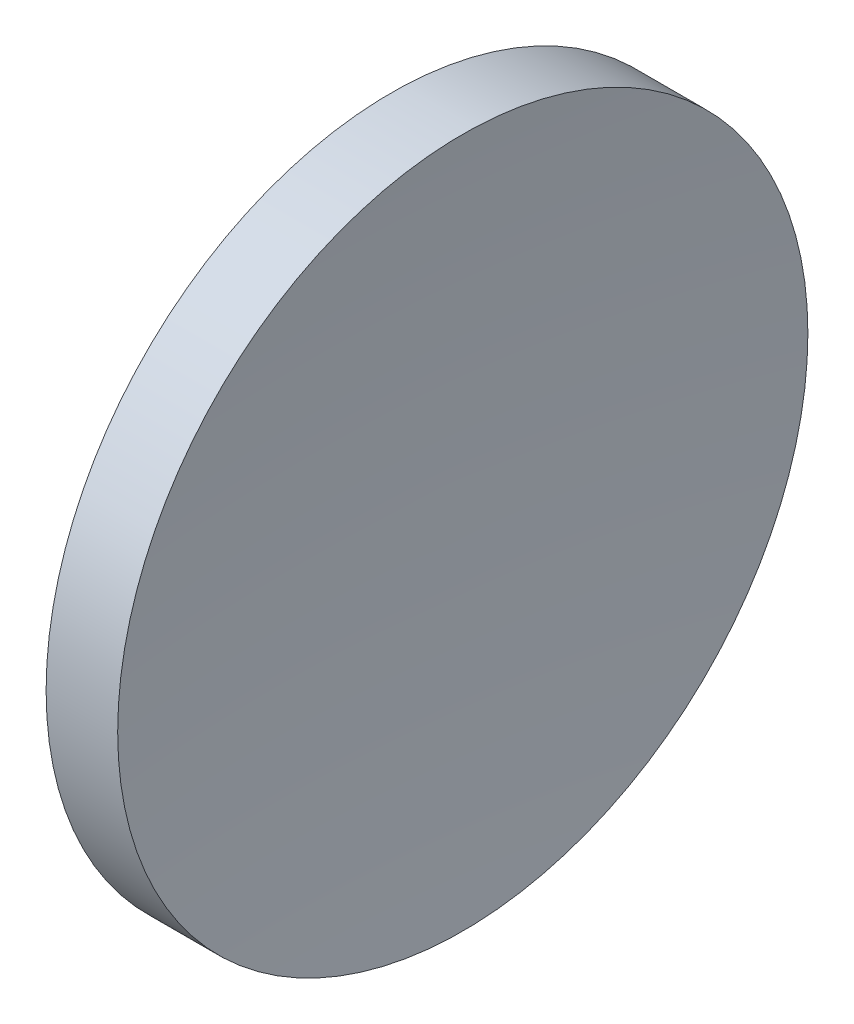
ISO-10303-21;
HEADER;
FILE_DESCRIPTION(('STEP AP214'),'2;1');
FILE_NAME('part.step','',(''),(''),'','','');
FILE_SCHEMA(('AUTOMOTIVE_DESIGN { 1 0 10303 214 1 1 1 1 }'));
ENDSEC;
DATA;
#1=APPLICATION_CONTEXT('core data for automotive mechanical design processes');
#2=APPLICATION_PROTOCOL_DEFINITION('international standard','automotive_design',2000,#1);
#3=PRODUCT_CONTEXT('',#1,'mechanical');
#4=PRODUCT('Part','Part','',(#3));
#5=PRODUCT_RELATED_PRODUCT_CATEGORY('part','',(#4));
#6=PRODUCT_DEFINITION_FORMATION('','',#4);
#7=PRODUCT_DEFINITION_CONTEXT('part definition',#1,'design');
#8=PRODUCT_DEFINITION('design','',#6,#7);
#9=PRODUCT_DEFINITION_SHAPE('','',#8);
#10=(LENGTH_UNIT() NAMED_UNIT(*) SI_UNIT(.MILLI.,.METRE.));
#11=(NAMED_UNIT(*) PLANE_ANGLE_UNIT() SI_UNIT($,.RADIAN.));
#12=(NAMED_UNIT(*) SI_UNIT($,.STERADIAN.) SOLID_ANGLE_UNIT());
#13=UNCERTAINTY_MEASURE_WITH_UNIT(LENGTH_MEASURE(1.E-05),#10,'distance_accuracy_value','');
#14=(GEOMETRIC_REPRESENTATION_CONTEXT(3) GLOBAL_UNCERTAINTY_ASSIGNED_CONTEXT((#13)) GLOBAL_UNIT_ASSIGNED_CONTEXT((#10,
#11,#12)) REPRESENTATION_CONTEXT('',''));
#15=CARTESIAN_POINT('',(0.,0.,0.));
#16=DIRECTION('',(0.,0.,1.));
#17=DIRECTION('',(1.,0.,0.));
#18=AXIS2_PLACEMENT_3D('',#15,#16,#17);
#19=CARTESIAN_POINT('',(188.66225462508,32.6107681292268,0.145903068317493));
#20=DIRECTION('',(0.,-1.,0.));
#21=DIRECTION('',(0.,0.,1.));
#22=AXIS2_PLACEMENT_3D('',#19,#20,#21);
#23=CIRCLE('',#22,129.13);
#24=TRIMMED_CURVE('',#23,(PARAMETER_VALUE(-1.57192621992091)),
(PARAMETER_VALUE(1.57192621992091)),.T.,.PARAMETER.);
#25=CARTESIAN_POINT('',(188.66225462508,32.6107681292268,0.));
#26=DIRECTION('',(-1.,0.,0.));
#27=AXIS1_PLACEMENT('',#25,#26);
#28=SURFACE_OF_REVOLUTION('',#24,#27);
#29=CARTESIAN_POINT('',(60.1245823690348,32.6107681292268,0.));
#30=DIRECTION('',(-1.,0.,0.));
#31=DIRECTION('',(0.,0.,1.));
#32=AXIS2_PLACEMENT_3D('',#29,#30,#31);
#33=CIRCLE('',#32,12.5);
#34=CARTESIAN_POINT('',(60.1245823690348,32.6107681292268,12.5));
#35=VERTEX_POINT('',#34);
#36=EDGE_CURVE('E11',#35,#35,#33,.T.);
#37=ORIENTED_EDGE('',*,*,#36,.F.);
#38=EDGE_LOOP('',(#37));
#39=FACE_BOUND('',#38,.T.);
#40=CARTESIAN_POINT('',(59.5323370525261,32.6107681292268,0.));
#41=VERTEX_POINT('',#40);
#42=VERTEX_LOOP('',#41);
#43=FACE_BOUND('',#42,.T.);
#44=ADVANCED_FACE('F37',(#39,#43),#28,.F.);
#45=CARTESIAN_POINT('',(56.1009150799972,32.6107681292268,0.));
#46=DIRECTION('',(-1.,0.,0.));
#47=DIRECTION('',(0.,0.,1.));
#48=AXIS2_PLACEMENT_3D('',#45,#46,#47);
#49=CYLINDRICAL_SURFACE('',#48,12.5);
#50=CARTESIAN_POINT('',(57.5323370525261,32.6107681292268,0.));
#51=DIRECTION('',(-1.,0.,0.));
#52=DIRECTION('',(0.,0.,1.));
#53=AXIS2_PLACEMENT_3D('',#50,#51,#52);
#54=CIRCLE('',#53,12.5);
#55=CARTESIAN_POINT('',(57.5323370525261,32.6107681292268,12.5));
#56=VERTEX_POINT('',#55);
#57=EDGE_CURVE('E43',#56,#56,#54,.T.);
#58=ORIENTED_EDGE('',*,*,#57,.F.);
#59=EDGE_LOOP('',(#58));
#60=FACE_BOUND('',#59,.T.);
#61=ORIENTED_EDGE('',*,*,#36,.T.);
#62=EDGE_LOOP('',(#61));
#63=FACE_BOUND('',#62,.T.);
#64=ADVANCED_FACE('F47',(#60,#63),#49,.T.);
#65=CARTESIAN_POINT('',(57.5323370525261,32.6107681292268,0.));
#66=DIRECTION('',(1.,0.,0.));
#67=DIRECTION('',(0.,0.,-1.));
#68=AXIS2_PLACEMENT_3D('',#65,#66,#67);
#69=PLANE('',#68);
#70=ORIENTED_EDGE('',*,*,#57,.T.);
#71=EDGE_LOOP('',(#70));
#72=FACE_BOUND('',#71,.T.);
#73=ADVANCED_FACE('F52',(#72),#69,.F.);
#74=CLOSED_SHELL('',(#44,#64,#73));
#75=MANIFOLD_SOLID_BREP('B2',#74);
#76=ADVANCED_BREP_SHAPE_REPRESENTATION('',(#18,#75),#14);
#77=SHAPE_DEFINITION_REPRESENTATION(#9,#76);
ENDSEC;
END-ISO-10303-21;
